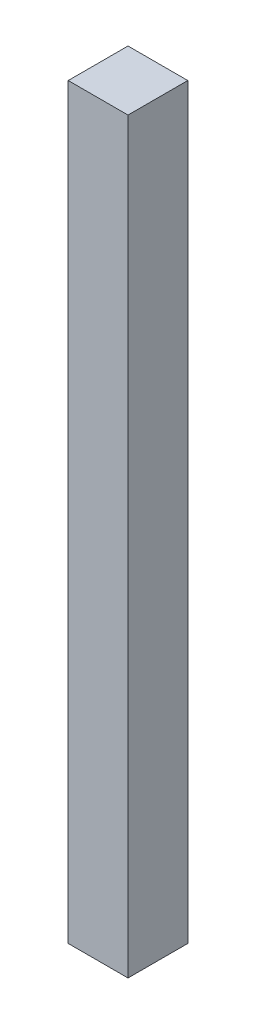
ISO-10303-21;
HEADER;
FILE_DESCRIPTION(('STEP AP214'),'2;1');
FILE_NAME('part.step','',(''),(''),'','','');
FILE_SCHEMA(('AUTOMOTIVE_DESIGN { 1 0 10303 214 1 1 1 1 }'));
ENDSEC;
DATA;
#1=APPLICATION_CONTEXT('core data for automotive mechanical design processes');
#2=APPLICATION_PROTOCOL_DEFINITION('international standard','automotive_design',2000,#1);
#3=PRODUCT_CONTEXT('',#1,'mechanical');
#4=PRODUCT('Part','Part','',(#3));
#5=PRODUCT_RELATED_PRODUCT_CATEGORY('part','',(#4));
#6=PRODUCT_DEFINITION_FORMATION('','',#4);
#7=PRODUCT_DEFINITION_CONTEXT('part definition',#1,'design');
#8=PRODUCT_DEFINITION('design','',#6,#7);
#9=PRODUCT_DEFINITION_SHAPE('','',#8);
#10=(LENGTH_UNIT() NAMED_UNIT(*) SI_UNIT(.MILLI.,.METRE.));
#11=(NAMED_UNIT(*) PLANE_ANGLE_UNIT() SI_UNIT($,.RADIAN.));
#12=(NAMED_UNIT(*) SI_UNIT($,.STERADIAN.) SOLID_ANGLE_UNIT());
#13=UNCERTAINTY_MEASURE_WITH_UNIT(LENGTH_MEASURE(1.E-05),#10,'distance_accuracy_value','');
#14=(GEOMETRIC_REPRESENTATION_CONTEXT(3) GLOBAL_UNCERTAINTY_ASSIGNED_CONTEXT((#13)) GLOBAL_UNIT_ASSIGNED_CONTEXT((#10,
#11,#12)) REPRESENTATION_CONTEXT('',''));
#15=CARTESIAN_POINT('',(0.,0.,0.));
#16=DIRECTION('',(0.,0.,1.));
#17=DIRECTION('',(1.,0.,0.));
#18=AXIS2_PLACEMENT_3D('',#15,#16,#17);
#19=CARTESIAN_POINT('',(20.,-250.,40.));
#20=DIRECTION('',(-1.,0.,0.));
#21=DIRECTION('',(0.,0.,1.));
#22=AXIS2_PLACEMENT_3D('',#19,#20,#21);
#23=PLANE('',#22);
#24=DIRECTION('',(0.,1.,0.));
#25=VECTOR('',#24,1.);
#26=CARTESIAN_POINT('',(20.,-250.,0.));
#27=LINE('',#26,#25);
#28=CARTESIAN_POINT('',(20.,-250.,0.));
#29=VERTEX_POINT('',#28);
#30=CARTESIAN_POINT('',(20.,250.,0.));
#31=VERTEX_POINT('',#30);
#32=EDGE_CURVE('E107',#29,#31,#27,.T.);
#33=ORIENTED_EDGE('',*,*,#32,.T.);
#34=DIRECTION('',(0.,0.,-1.));
#35=VECTOR('',#34,1.);
#36=CARTESIAN_POINT('',(20.,250.,40.));
#37=LINE('',#36,#35);
#38=CARTESIAN_POINT('',(20.,250.,40.));
#39=VERTEX_POINT('',#38);
#40=EDGE_CURVE('E11',#39,#31,#37,.T.);
#41=ORIENTED_EDGE('',*,*,#40,.F.);
#42=DIRECTION('',(0.,1.,0.));
#43=VECTOR('',#42,1.);
#44=CARTESIAN_POINT('',(20.,-250.,40.));
#45=LINE('',#44,#43);
#46=CARTESIAN_POINT('',(20.,-250.,40.));
#47=VERTEX_POINT('',#46);
#48=EDGE_CURVE('E91',#47,#39,#45,.T.);
#49=ORIENTED_EDGE('',*,*,#48,.F.);
#50=DIRECTION('',(0.,0.,-1.));
#51=VECTOR('',#50,1.);
#52=CARTESIAN_POINT('',(20.,-250.,40.));
#53=LINE('',#52,#51);
#54=EDGE_CURVE('E103',#47,#29,#53,.T.);
#55=ORIENTED_EDGE('',*,*,#54,.T.);
#56=EDGE_LOOP('',(#33,#41,#49,#55));
#57=FACE_BOUND('',#56,.T.);
#58=ADVANCED_FACE('F39',(#57),#23,.F.);
#59=CARTESIAN_POINT('',(-20.,250.,40.));
#60=DIRECTION('',(0.,-1.,0.));
#61=DIRECTION('',(0.,0.,-1.));
#62=AXIS2_PLACEMENT_3D('',#59,#60,#61);
#63=PLANE('',#62);
#64=DIRECTION('',(-1.,0.,0.));
#65=VECTOR('',#64,1.);
#66=CARTESIAN_POINT('',(-20.,250.,0.));
#67=LINE('',#66,#65);
#68=CARTESIAN_POINT('',(-20.,250.,0.));
#69=VERTEX_POINT('',#68);
#70=EDGE_CURVE('E96',#31,#69,#67,.T.);
#71=ORIENTED_EDGE('',*,*,#70,.T.);
#72=DIRECTION('',(0.,0.,-1.));
#73=VECTOR('',#72,1.);
#74=CARTESIAN_POINT('',(-20.,250.,40.));
#75=LINE('',#74,#73);
#76=CARTESIAN_POINT('',(-20.,250.,40.));
#77=VERTEX_POINT('',#76);
#78=EDGE_CURVE('E48',#77,#69,#75,.T.);
#79=ORIENTED_EDGE('',*,*,#78,.F.);
#80=DIRECTION('',(-1.,0.,0.));
#81=VECTOR('',#80,1.);
#82=CARTESIAN_POINT('',(-20.,250.,40.));
#83=LINE('',#82,#81);
#84=EDGE_CURVE('E86',#39,#77,#83,.T.);
#85=ORIENTED_EDGE('',*,*,#84,.F.);
#86=ORIENTED_EDGE('',*,*,#40,.T.);
#87=EDGE_LOOP('',(#71,#79,#85,#86));
#88=FACE_BOUND('',#87,.T.);
#89=ADVANCED_FACE('F95',(#88),#63,.F.);
#90=CARTESIAN_POINT('',(-20.,-250.,40.));
#91=DIRECTION('',(1.,0.,0.));
#92=DIRECTION('',(0.,0.,-1.));
#93=AXIS2_PLACEMENT_3D('',#90,#91,#92);
#94=PLANE('',#93);
#95=DIRECTION('',(0.,-1.,0.));
#96=VECTOR('',#95,1.);
#97=CARTESIAN_POINT('',(-20.,-250.,0.));
#98=LINE('',#97,#96);
#99=CARTESIAN_POINT('',(-20.,-250.,0.));
#100=VERTEX_POINT('',#99);
#101=EDGE_CURVE('E73',#69,#100,#98,.T.);
#102=ORIENTED_EDGE('',*,*,#101,.T.);
#103=DIRECTION('',(0.,0.,-1.));
#104=VECTOR('',#103,1.);
#105=CARTESIAN_POINT('',(-20.,-250.,40.));
#106=LINE('',#105,#104);
#107=CARTESIAN_POINT('',(-20.,-250.,40.));
#108=VERTEX_POINT('',#107);
#109=EDGE_CURVE('E98',#108,#100,#106,.T.);
#110=ORIENTED_EDGE('',*,*,#109,.F.);
#111=DIRECTION('',(0.,-1.,0.));
#112=VECTOR('',#111,1.);
#113=CARTESIAN_POINT('',(-20.,-250.,40.));
#114=LINE('',#113,#112);
#115=EDGE_CURVE('E89',#77,#108,#114,.T.);
#116=ORIENTED_EDGE('',*,*,#115,.F.);
#117=ORIENTED_EDGE('',*,*,#78,.T.);
#118=EDGE_LOOP('',(#102,#110,#116,#117));
#119=FACE_BOUND('',#118,.T.);
#120=ADVANCED_FACE('F99',(#119),#94,.F.);
#121=CARTESIAN_POINT('',(-20.,-250.,40.));
#122=DIRECTION('',(0.,1.,0.));
#123=DIRECTION('',(0.,0.,1.));
#124=AXIS2_PLACEMENT_3D('',#121,#122,#123);
#125=PLANE('',#124);
#126=DIRECTION('',(1.,0.,0.));
#127=VECTOR('',#126,1.);
#128=CARTESIAN_POINT('',(-20.,-250.,0.));
#129=LINE('',#128,#127);
#130=EDGE_CURVE('E79',#100,#29,#129,.T.);
#131=ORIENTED_EDGE('',*,*,#130,.T.);
#132=ORIENTED_EDGE('',*,*,#54,.F.);
#133=DIRECTION('',(1.,0.,0.));
#134=VECTOR('',#133,1.);
#135=CARTESIAN_POINT('',(-20.,-250.,40.));
#136=LINE('',#135,#134);
#137=EDGE_CURVE('E56',#108,#47,#136,.T.);
#138=ORIENTED_EDGE('',*,*,#137,.F.);
#139=ORIENTED_EDGE('',*,*,#109,.T.);
#140=EDGE_LOOP('',(#131,#132,#138,#139));
#141=FACE_BOUND('',#140,.T.);
#142=ADVANCED_FACE('F120',(#141),#125,.F.);
#143=CARTESIAN_POINT('',(0.,0.,40.));
#144=DIRECTION('',(0.,0.,-1.));
#145=DIRECTION('',(-1.,0.,0.));
#146=AXIS2_PLACEMENT_3D('',#143,#144,#145);
#147=PLANE('',#146);
#148=ORIENTED_EDGE('',*,*,#48,.T.);
#149=ORIENTED_EDGE('',*,*,#84,.T.);
#150=ORIENTED_EDGE('',*,*,#115,.T.);
#151=ORIENTED_EDGE('',*,*,#137,.T.);
#152=EDGE_LOOP('',(#148,#149,#150,#151));
#153=FACE_BOUND('',#152,.T.);
#154=ADVANCED_FACE('F87',(#153),#147,.F.);
#155=CARTESIAN_POINT('',(0.,0.,0.));
#156=DIRECTION('',(0.,0.,-1.));
#157=DIRECTION('',(-1.,0.,0.));
#158=AXIS2_PLACEMENT_3D('',#155,#156,#157);
#159=PLANE('',#158);
#160=ORIENTED_EDGE('',*,*,#32,.F.);
#161=ORIENTED_EDGE('',*,*,#130,.F.);
#162=ORIENTED_EDGE('',*,*,#101,.F.);
#163=ORIENTED_EDGE('',*,*,#70,.F.);
#164=EDGE_LOOP('',(#160,#161,#162,#163));
#165=FACE_BOUND('',#164,.T.);
#166=ADVANCED_FACE('F123',(#165),#159,.T.);
#167=CLOSED_SHELL('',(#58,#89,#120,#142,#154,#166));
#168=MANIFOLD_SOLID_BREP('B2',#167);
#169=ADVANCED_BREP_SHAPE_REPRESENTATION('',(#18,#168),#14);
#170=SHAPE_DEFINITION_REPRESENTATION(#9,#169);
ENDSEC;
END-ISO-10303-21;
